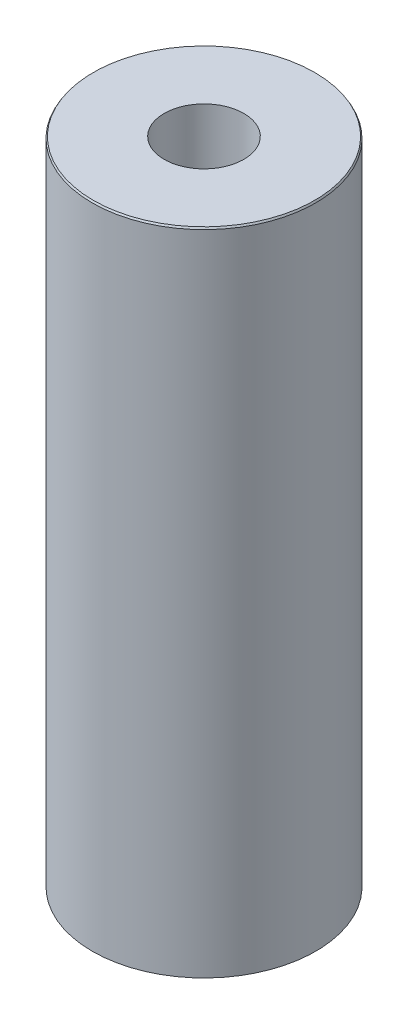
ISO-10303-21;
HEADER;
FILE_DESCRIPTION(('STEP AP214'),'2;1');
FILE_NAME('part.step','',(''),(''),'','','');
FILE_SCHEMA(('AUTOMOTIVE_DESIGN { 1 0 10303 214 1 1 1 1 }'));
ENDSEC;
DATA;
#1=APPLICATION_CONTEXT('core data for automotive mechanical design processes');
#2=APPLICATION_PROTOCOL_DEFINITION('international standard','automotive_design',2000,#1);
#3=PRODUCT_CONTEXT('',#1,'mechanical');
#4=PRODUCT('Part','Part','',(#3));
#5=PRODUCT_RELATED_PRODUCT_CATEGORY('part','',(#4));
#6=PRODUCT_DEFINITION_FORMATION('','',#4);
#7=PRODUCT_DEFINITION_CONTEXT('part definition',#1,'design');
#8=PRODUCT_DEFINITION('design','',#6,#7);
#9=PRODUCT_DEFINITION_SHAPE('','',#8);
#10=(LENGTH_UNIT() NAMED_UNIT(*) SI_UNIT(.MILLI.,.METRE.));
#11=(NAMED_UNIT(*) PLANE_ANGLE_UNIT() SI_UNIT($,.RADIAN.));
#12=(NAMED_UNIT(*) SI_UNIT($,.STERADIAN.) SOLID_ANGLE_UNIT());
#13=UNCERTAINTY_MEASURE_WITH_UNIT(LENGTH_MEASURE(1.E-05),#10,'distance_accuracy_value','');
#14=(GEOMETRIC_REPRESENTATION_CONTEXT(3) GLOBAL_UNCERTAINTY_ASSIGNED_CONTEXT((#13)) GLOBAL_UNIT_ASSIGNED_CONTEXT((#10,
#11,#12)) REPRESENTATION_CONTEXT('',''));
#15=CARTESIAN_POINT('',(0.,0.,0.));
#16=DIRECTION('',(0.,0.,1.));
#17=DIRECTION('',(1.,0.,0.));
#18=AXIS2_PLACEMENT_3D('',#15,#16,#17);
#19=CARTESIAN_POINT('',(0.,305.770544254768,0.));
#20=DIRECTION('',(0.,-1.,0.));
#21=DIRECTION('',(0.,0.,-1.));
#22=AXIS2_PLACEMENT_3D('',#19,#20,#21);
#23=CYLINDRICAL_SURFACE('',#22,52.5);
#24=CARTESIAN_POINT('',(0.,304.954214746591,0.));
#25=DIRECTION('',(0.,1.,0.));
#26=DIRECTION('',(0.,0.,1.));
#27=AXIS2_PLACEMENT_3D('',#24,#25,#26);
#28=CIRCLE('',#27,52.5);
#29=CARTESIAN_POINT('',(0.,304.954214746591,-52.5));
#30=VERTEX_POINT('',#29);
#31=EDGE_CURVE('E50',#30,#30,#28,.F.);
#32=CARTESIAN_POINT('',(0.,0.471308061293585,0.));
#33=DIRECTION('',(0.,1.,0.));
#34=DIRECTION('',(0.,0.,1.));
#35=AXIS2_PLACEMENT_3D('',#32,#33,#34);
#36=CIRCLE('',#35,52.5);
#37=CARTESIAN_POINT('',(0.,0.471308061293529,-52.5));
#38=VERTEX_POINT('',#37);
#39=EDGE_CURVE('E51',#38,#38,#36,.T.);
#40=CARTESIAN_POINT('',(0.,304.954214746591,-52.5));
#41=CARTESIAN_POINT('',(0.,301.782517801953,-52.5));
#42=CARTESIAN_POINT('',(0.,298.610820857314,-52.5));
#43=CARTESIAN_POINT('',(0.,292.267426968037,-52.5));
#44=CARTESIAN_POINT('',(0.,289.095730023399,-52.5));
#45=CARTESIAN_POINT('',(0.,282.752336134122,-52.5));
#46=CARTESIAN_POINT('',(0.,279.580639189483,-52.5));
#47=CARTESIAN_POINT('',(0.,273.237245300206,-52.5));
#48=CARTESIAN_POINT('',(0.,270.065548355568,-52.5));
#49=CARTESIAN_POINT('',(0.,263.722154466291,-52.5));
#50=CARTESIAN_POINT('',(0.,260.550457521652,-52.5));
#51=CARTESIAN_POINT('',(0.,254.207063632375,-52.5));
#52=CARTESIAN_POINT('',(0.,251.035366687737,-52.5));
#53=CARTESIAN_POINT('',(0.,244.691972798459,-52.5));
#54=CARTESIAN_POINT('',(0.,241.520275853821,-52.5));
#55=CARTESIAN_POINT('',(0.,235.176881964544,-52.5));
#56=CARTESIAN_POINT('',(0.,232.005185019905,-52.5));
#57=CARTESIAN_POINT('',(0.,225.661791130628,-52.5));
#58=CARTESIAN_POINT('',(0.,222.49009418599,-52.5));
#59=CARTESIAN_POINT('',(0.,216.146700296713,-52.5));
#60=CARTESIAN_POINT('',(0.,212.975003352074,-52.5));
#61=CARTESIAN_POINT('',(0.,206.631609462797,-52.5));
#62=CARTESIAN_POINT('',(0.,203.459912518159,-52.5));
#63=CARTESIAN_POINT('',(0.,197.116518628882,-52.5));
#64=CARTESIAN_POINT('',(0.,193.944821684243,-52.5));
#65=CARTESIAN_POINT('',(0.,187.601427794966,-52.5));
#66=CARTESIAN_POINT('',(0.,184.429730850328,-52.5));
#67=CARTESIAN_POINT('',(0.,178.086336961051,-52.5));
#68=CARTESIAN_POINT('',(0.,174.914640016412,-52.5));
#69=CARTESIAN_POINT('',(0.,168.571246127135,-52.5));
#70=CARTESIAN_POINT('',(0.,165.399549182496,-52.5));
#71=CARTESIAN_POINT('',(0.,159.056155293219,-52.5));
#72=CARTESIAN_POINT('',(0.,155.884458348581,-52.5));
#73=CARTESIAN_POINT('',(0.,149.541064459304,-52.5));
#74=CARTESIAN_POINT('',(0.,146.369367514665,-52.5));
#75=CARTESIAN_POINT('',(0.,140.025973625388,-52.5));
#76=CARTESIAN_POINT('',(0.,136.85427668075,-52.5));
#77=CARTESIAN_POINT('',(0.,130.510882791473,-52.5));
#78=CARTESIAN_POINT('',(0.,127.339185846834,-52.5));
#79=CARTESIAN_POINT('',(0.,120.995791957557,-52.5));
#80=CARTESIAN_POINT('',(0.,117.824095012919,-52.5));
#81=CARTESIAN_POINT('',(0.,111.480701123642,-52.5));
#82=CARTESIAN_POINT('',(0.,108.309004179003,-52.5));
#83=CARTESIAN_POINT('',(0.,101.965610289726,-52.5));
#84=CARTESIAN_POINT('',(0.,98.7939133450876,-52.5));
#85=CARTESIAN_POINT('',(0.,92.4505194558106,-52.5));
#86=CARTESIAN_POINT('',(0.,89.2788225111721,-52.5));
#87=CARTESIAN_POINT('',(0.,82.935428621895,-52.5));
#88=CARTESIAN_POINT('',(0.,79.7637316772565,-52.5));
#89=CARTESIAN_POINT('',(0.,73.4203377879795,-52.5));
#90=CARTESIAN_POINT('',(0.,70.2486408433409,-52.5));
#91=CARTESIAN_POINT('',(0.,63.9052469540639,-52.5));
#92=CARTESIAN_POINT('',(0.,60.7335500094254,-52.5));
#93=CARTESIAN_POINT('',(0.,54.3901561201483,-52.5));
#94=CARTESIAN_POINT('',(0.,51.2184591755098,-52.5));
#95=CARTESIAN_POINT('',(0.,44.8750652862328,-52.5));
#96=CARTESIAN_POINT('',(0.,41.7033683415942,-52.5));
#97=CARTESIAN_POINT('',(0.,35.3599744523172,-52.5));
#98=CARTESIAN_POINT('',(0.,32.1882775076787,-52.5));
#99=CARTESIAN_POINT('',(0.,25.8448836184017,-52.5));
#100=CARTESIAN_POINT('',(0.,22.6731866737632,-52.5));
#101=CARTESIAN_POINT('',(0.,16.3297927844861,-52.5));
#102=CARTESIAN_POINT('',(0.,13.1580958398476,-52.5));
#103=CARTESIAN_POINT('',(0.,6.81470195057056,-52.5));
#104=CARTESIAN_POINT('',(0.,3.64300500593204,-52.5));
#105=CARTESIAN_POINT('',(0.,0.471308061293529,-52.5));
#106=B_SPLINE_CURVE_WITH_KNOTS('',3,(#40,#41,#42,#43,#44,#45,#46,#47,#48,#49,#50,#51,#52,#53,
#54,#55,#56,#57,#58,#59,#60,#61,#62,#63,#64,#65,#66,#67,#68,#69,#70,#71,#72,#73,#74,#75,#76,#77,
#78,#79,#80,#81,#82,#83,#84,#85,#86,#87,#88,#89,#90,#91,#92,#93,#94,#95,#96,#97,#98,#99,#100,
#101,#102,#103,#104,#105),.UNSPECIFIED.,.F.,.F.,(4,2,2,2,2,2,2,2,2,2,2,2,2,2,2,2,2,2,2,2,2,2,2,
2,2,2,2,2,2,2,2,2,4),(0.,9.51509083391555,19.0301816678311,28.5452725017467,38.0603633356622,
47.5754541695778,57.0905450034933,66.6056358374089,76.1207266713244,85.63581750524,
95.1509083391555,104.665999173071,114.181090006987,123.696180840902,133.211271674818,
142.726362508733,152.241453342649,161.756544176564,171.27163501048,180.786725844396,
190.301816678311,199.816907512227,209.331998346142,218.847089180058,228.362180013973,
237.877270847889,247.392361681804,256.90745251572,266.422543349636,275.937634183551,
285.452725017467,294.967815851382,304.482906685298),.UNSPECIFIED.);
#107=EDGE_CURVE('BSEAM39',#30,#38,#106,.T.);
#108=ORIENTED_EDGE('',*,*,#31,.T.);
#109=ORIENTED_EDGE('',*,*,#39,.T.);
#110=ORIENTED_EDGE('',*,*,#107,.T.);
#111=ORIENTED_EDGE('',*,*,#107,.F.);
#112=EDGE_LOOP('',(#108,#110,#109,#111));
#113=FACE_BOUND('',#112,.T.);
#114=ADVANCED_FACE('F39',(#113),#23,.T.);
#115=CARTESIAN_POINT('',(0.,305.770544254768,0.));
#116=DIRECTION('',(0.,1.,0.));
#117=DIRECTION('',(0.,0.,1.));
#118=AXIS2_PLACEMENT_3D('',#115,#116,#117);
#119=PLANE('',#118);
#120=CARTESIAN_POINT('',(0.,305.770544254768,0.));
#121=DIRECTION('',(0.,1.,0.));
#122=DIRECTION('',(0.,0.,1.));
#123=AXIS2_PLACEMENT_3D('',#120,#121,#122);
#124=CIRCLE('',#123,52.0286919387067);
#125=CARTESIAN_POINT('',(0.,305.770544254768,-52.0286919387067));
#126=VERTEX_POINT('',#125);
#127=EDGE_CURVE('E54',#126,#126,#124,.T.);
#128=ORIENTED_EDGE('',*,*,#127,.T.);
#129=EDGE_LOOP('',(#128));
#130=FACE_BOUND('',#129,.T.);
#131=CARTESIAN_POINT('',(0.,305.770544254768,0.));
#132=DIRECTION('',(0.,1.,0.));
#133=DIRECTION('',(0.,0.,1.));
#134=AXIS2_PLACEMENT_3D('',#131,#132,#133);
#135=CIRCLE('',#134,18.7173574236483);
#136=CARTESIAN_POINT('',(0.,305.770544254768,-18.7173574236483));
#137=VERTEX_POINT('',#136);
#138=EDGE_CURVE('E58',#137,#137,#135,.T.);
#139=ORIENTED_EDGE('',*,*,#138,.F.);
#140=EDGE_LOOP('',(#139));
#141=FACE_BOUND('',#140,.T.);
#142=ADVANCED_FACE('F69',(#130,#141),#119,.T.);
#143=CARTESIAN_POINT('',(0.,0.,0.));
#144=DIRECTION('',(0.,1.,0.));
#145=DIRECTION('',(0.,0.,1.));
#146=AXIS2_PLACEMENT_3D('',#143,#144,#145);
#147=PLANE('',#146);
#148=CARTESIAN_POINT('',(0.,0.,0.));
#149=DIRECTION('',(0.,1.,0.));
#150=DIRECTION('',(0.,0.,1.));
#151=AXIS2_PLACEMENT_3D('',#148,#149,#150);
#152=CIRCLE('',#151,51.6836704918228);
#153=CARTESIAN_POINT('',(0.,0.,51.6836704918228));
#154=VERTEX_POINT('',#153);
#155=EDGE_CURVE('E10',#154,#154,#152,.F.);
#156=ORIENTED_EDGE('',*,*,#155,.T.);
#157=EDGE_LOOP('',(#156));
#158=FACE_BOUND('',#157,.T.);
#159=CARTESIAN_POINT('',(0.,0.,0.));
#160=DIRECTION('',(0.,1.,0.));
#161=DIRECTION('',(0.,0.,1.));
#162=AXIS2_PLACEMENT_3D('',#159,#160,#161);
#163=CIRCLE('',#162,18.7173574236483);
#164=CARTESIAN_POINT('',(0.,0.,-18.7173574236483));
#165=VERTEX_POINT('',#164);
#166=EDGE_CURVE('E63',#165,#165,#163,.T.);
#167=ORIENTED_EDGE('',*,*,#166,.T.);
#168=EDGE_LOOP('',(#167));
#169=FACE_BOUND('',#168,.T.);
#170=ADVANCED_FACE('F75',(#158,#169),#147,.F.);
#171=CARTESIAN_POINT('',(0.,305.770544254768,0.));
#172=DIRECTION('',(0.,-1.,0.));
#173=DIRECTION('',(0.,0.,-1.));
#174=AXIS2_PLACEMENT_3D('',#171,#172,#173);
#175=CYLINDRICAL_SURFACE('',#174,18.7173574236483);
#176=CARTESIAN_POINT('',(0.,305.770544254768,-18.7173574236483));
#177=CARTESIAN_POINT('',(0.,302.585434418781,-18.7173574236483));
#178=CARTESIAN_POINT('',(0.,299.400324582794,-18.7173574236483));
#179=CARTESIAN_POINT('',(0.,293.03010491082,-18.7173574236483));
#180=CARTESIAN_POINT('',(0.,289.844995074832,-18.7173574236483));
#181=CARTESIAN_POINT('',(0.,283.474775402858,-18.7173574236483));
#182=CARTESIAN_POINT('',(0.,280.289665566871,-18.7173574236483));
#183=CARTESIAN_POINT('',(0.,273.919445894897,-18.7173574236483));
#184=CARTESIAN_POINT('',(0.,270.734336058909,-18.7173574236483));
#185=CARTESIAN_POINT('',(0.,264.364116386935,-18.7173574236483));
#186=CARTESIAN_POINT('',(0.,261.179006550948,-18.7173574236483));
#187=CARTESIAN_POINT('',(0.,254.808786878973,-18.7173574236483));
#188=CARTESIAN_POINT('',(0.,251.623677042986,-18.7173574236483));
#189=CARTESIAN_POINT('',(0.,245.253457371012,-18.7173574236483));
#190=CARTESIAN_POINT('',(0.,242.068347535025,-18.7173574236483));
#191=CARTESIAN_POINT('',(0.,235.698127863051,-18.7173574236483));
#192=CARTESIAN_POINT('',(0.,232.513018027063,-18.7173574236483));
#193=CARTESIAN_POINT('',(0.,226.142798355089,-18.7173574236483));
#194=CARTESIAN_POINT('',(0.,222.957688519102,-18.7173574236483));
#195=CARTESIAN_POINT('',(0.,216.587468847127,-18.7173574236483));
#196=CARTESIAN_POINT('',(0.,213.40235901114,-18.7173574236483));
#197=CARTESIAN_POINT('',(0.,207.032139339166,-18.7173574236483));
#198=CARTESIAN_POINT('',(0.,203.847029503179,-18.7173574236483));
#199=CARTESIAN_POINT('',(0.,197.476809831204,-18.7173574236483));
#200=CARTESIAN_POINT('',(0.,194.291699995217,-18.7173574236483));
#201=CARTESIAN_POINT('',(0.,187.921480323243,-18.7173574236483));
#202=CARTESIAN_POINT('',(0.,184.736370487256,-18.7173574236483));
#203=CARTESIAN_POINT('',(0.,178.366150815281,-18.7173574236483));
#204=CARTESIAN_POINT('',(0.,175.181040979294,-18.7173574236483));
#205=CARTESIAN_POINT('',(0.,168.81082130732,-18.7173574236483));
#206=CARTESIAN_POINT('',(0.,165.625711471333,-18.7173574236483));
#207=CARTESIAN_POINT('',(0.,159.255491799358,-18.7173574236483));
#208=CARTESIAN_POINT('',(0.,156.070381963371,-18.7173574236483));
#209=CARTESIAN_POINT('',(0.,149.700162291397,-18.7173574236483));
#210=CARTESIAN_POINT('',(0.,146.51505245541,-18.7173574236483));
#211=CARTESIAN_POINT('',(0.,140.144832783435,-18.7173574236483));
#212=CARTESIAN_POINT('',(0.,136.959722947448,-18.7173574236483));
#213=CARTESIAN_POINT('',(0.,130.589503275474,-18.7173574236483));
#214=CARTESIAN_POINT('',(0.,127.404393439487,-18.7173574236483));
#215=CARTESIAN_POINT('',(0.,121.034173767512,-18.7173574236483));
#216=CARTESIAN_POINT('',(0.,117.849063931525,-18.7173574236483));
#217=CARTESIAN_POINT('',(0.,111.478844259551,-18.7173574236483));
#218=CARTESIAN_POINT('',(0.,108.293734423564,-18.7173574236483));
#219=CARTESIAN_POINT('',(0.,101.923514751589,-18.7173574236483));
#220=CARTESIAN_POINT('',(0.,98.7384049156022,-18.7173574236483));
#221=CARTESIAN_POINT('',(0.,92.3681852436279,-18.7173574236483));
#222=CARTESIAN_POINT('',(0.,89.1830754076407,-18.7173574236483));
#223=CARTESIAN_POINT('',(0.,82.8128557356664,-18.7173574236483));
#224=CARTESIAN_POINT('',(0.,79.6277458996792,-18.7173574236483));
#225=CARTESIAN_POINT('',(0.,73.2575262277048,-18.7173574236483));
#226=CARTESIAN_POINT('',(0.,70.0724163917177,-18.7173574236483));
#227=CARTESIAN_POINT('',(0.,63.7021967197433,-18.7173574236483));
#228=CARTESIAN_POINT('',(0.,60.5170868837562,-18.7173574236483));
#229=CARTESIAN_POINT('',(0.,54.1468672117818,-18.7173574236483));
#230=CARTESIAN_POINT('',(0.,50.9617573757946,-18.7173574236483));
#231=CARTESIAN_POINT('',(0.,44.5915377038203,-18.7173574236483));
#232=CARTESIAN_POINT('',(0.,41.4064278678331,-18.7173574236483));
#233=CARTESIAN_POINT('',(0.,35.0362081958588,-18.7173574236483));
#234=CARTESIAN_POINT('',(0.,31.8510983598716,-18.7173574236483));
#235=CARTESIAN_POINT('',(0.,25.4808786878973,-18.7173574236483));
#236=CARTESIAN_POINT('',(0.,22.2957688519101,-18.7173574236483));
#237=CARTESIAN_POINT('',(0.,15.9255491799358,-18.7173574236483));
#238=CARTESIAN_POINT('',(0.,12.7404393439486,-18.7173574236483));
#239=CARTESIAN_POINT('',(0.,6.37021967197428,-18.7173574236483));
#240=CARTESIAN_POINT('',(0.,3.18510983598712,-18.7173574236483));
#241=CARTESIAN_POINT('',(0.,0.,-18.7173574236483));
#242=B_SPLINE_CURVE_WITH_KNOTS('',3,(#176,#177,#178,#179,#180,#181,#182,#183,#184,#185,#186,
#187,#188,#189,#190,#191,#192,#193,#194,#195,#196,#197,#198,#199,#200,#201,#202,#203,#204,#205,
#206,#207,#208,#209,#210,#211,#212,#213,#214,#215,#216,#217,#218,#219,#220,#221,#222,#223,#224,
#225,#226,#227,#228,#229,#230,#231,#232,#233,#234,#235,#236,#237,#238,#239,#240,#241),
.UNSPECIFIED.,.F.,.F.,(4,2,2,2,2,2,2,2,2,2,2,2,2,2,2,2,2,2,2,2,2,2,2,2,2,2,2,2,2,2,2,2,4),(0.,
9.55532950796151,19.110659015923,28.6659885238845,38.221318031846,47.7766475398075,
57.331977047769,66.8873065557305,76.442636063692,85.9979655716535,95.553295079615,
105.108624587577,114.663954095538,124.2192836035,133.774613111461,143.329942619423,
152.885272127384,162.440601635346,171.995931143307,181.551260651269,191.10659015923,
200.661919667192,210.217249175153,219.772578683115,229.327908191076,238.883237699038,
248.438567206999,257.993896714961,267.549226222922,277.104555730884,286.659885238845,
296.215214746807,305.770544254768),.UNSPECIFIED.);
#243=EDGE_CURVE('BSEAM70',#137,#165,#242,.T.);
#244=ORIENTED_EDGE('',*,*,#138,.T.);
#245=ORIENTED_EDGE('',*,*,#166,.F.);
#246=ORIENTED_EDGE('',*,*,#243,.T.);
#247=ORIENTED_EDGE('',*,*,#243,.F.);
#248=EDGE_LOOP('',(#244,#246,#245,#247));
#249=FACE_BOUND('',#248,.T.);
#250=ADVANCED_FACE('F70',(#249),#175,.F.);
#251=CARTESIAN_POINT('',(0.,305.770544254768,0.));
#252=DIRECTION('',(0.,-1.,0.));
#253=DIRECTION('',(0.,0.,-1.));
#254=AXIS2_PLACEMENT_3D('',#251,#252,#253);
#255=CONICAL_SURFACE('',#254,52.0286919387067,0.523598775598259);
#256=CARTESIAN_POINT('',(0.,304.954214746591,-52.5));
#257=CARTESIAN_POINT('',(0.,304.962718178968,-52.4950905410282));
#258=CARTESIAN_POINT('',(0.,304.971221611345,-52.4901810820564));
#259=CARTESIAN_POINT('',(0.,304.988228476099,-52.4803621641128));
#260=CARTESIAN_POINT('',(0.,304.996731908476,-52.475452705141));
#261=CARTESIAN_POINT('',(0.,305.013738773229,-52.4656337871974));
#262=CARTESIAN_POINT('',(0.,305.022242205606,-52.4607243282256));
#263=CARTESIAN_POINT('',(0.,305.03924907036,-52.450905410282));
#264=CARTESIAN_POINT('',(0.,305.047752502737,-52.4459959513102));
#265=CARTESIAN_POINT('',(0.,305.06475936749,-52.4361770333665));
#266=CARTESIAN_POINT('',(0.,305.073262799867,-52.4312675743947));
#267=CARTESIAN_POINT('',(0.,305.090269664621,-52.4214486564511));
#268=CARTESIAN_POINT('',(0.,305.098773096998,-52.4165391974793));
#269=CARTESIAN_POINT('',(0.,305.115779961751,-52.4067202795357));
#270=CARTESIAN_POINT('',(0.,305.124283394128,-52.4018108205639));
#271=CARTESIAN_POINT('',(0.,305.141290258882,-52.3919919026203));
#272=CARTESIAN_POINT('',(0.,305.149793691259,-52.3870824436485));
#273=CARTESIAN_POINT('',(0.,305.166800556012,-52.3772635257049));
#274=CARTESIAN_POINT('',(0.,305.175303988389,-52.3723540667331));
#275=CARTESIAN_POINT('',(0.,305.192310853143,-52.3625351487895));
#276=CARTESIAN_POINT('',(0.,305.20081428552,-52.3576256898177));
#277=CARTESIAN_POINT('',(0.,305.217821150273,-52.347806771874));
#278=CARTESIAN_POINT('',(0.,305.22632458265,-52.3428973129022));
#279=CARTESIAN_POINT('',(0.,305.243331447404,-52.3330783949586));
#280=CARTESIAN_POINT('',(0.,305.251834879781,-52.3281689359868));
#281=CARTESIAN_POINT('',(0.,305.268841744534,-52.3183500180432));
#282=CARTESIAN_POINT('',(0.,305.277345176911,-52.3134405590714));
#283=CARTESIAN_POINT('',(0.,305.294352041665,-52.3036216411278));
#284=CARTESIAN_POINT('',(0.,305.302855474042,-52.298712182156));
#285=CARTESIAN_POINT('',(0.,305.319862338796,-52.2888932642124));
#286=CARTESIAN_POINT('',(0.,305.328365771172,-52.2839838052406));
#287=CARTESIAN_POINT('',(0.,305.345372635926,-52.274164887297));
#288=CARTESIAN_POINT('',(0.,305.353876068303,-52.2692554283252));
#289=CARTESIAN_POINT('',(0.,305.370882933057,-52.2594365103815));
#290=CARTESIAN_POINT('',(0.,305.379386365433,-52.2545270514097));
#291=CARTESIAN_POINT('',(0.,305.396393230187,-52.2447081334661));
#292=CARTESIAN_POINT('',(0.,305.404896662564,-52.2397986744943));
#293=CARTESIAN_POINT('',(0.,305.421903527318,-52.2299797565507));
#294=CARTESIAN_POINT('',(0.,305.430406959694,-52.2250702975789));
#295=CARTESIAN_POINT('',(0.,305.447413824448,-52.2152513796353));
#296=CARTESIAN_POINT('',(0.,305.455917256825,-52.2103419206635));
#297=CARTESIAN_POINT('',(0.,305.472924121579,-52.2005230027199));
#298=CARTESIAN_POINT('',(0.,305.481427553956,-52.1956135437481));
#299=CARTESIAN_POINT('',(0.,305.498434418709,-52.1857946258045));
#300=CARTESIAN_POINT('',(0.,305.506937851086,-52.1808851668327));
#301=CARTESIAN_POINT('',(0.,305.52394471584,-52.171066248889));
#302=CARTESIAN_POINT('',(0.,305.532448148217,-52.1661567899172));
#303=CARTESIAN_POINT('',(0.,305.54945501297,-52.1563378719736));
#304=CARTESIAN_POINT('',(0.,305.557958445347,-52.1514284130018));
#305=CARTESIAN_POINT('',(0.,305.574965310101,-52.1416094950582));
#306=CARTESIAN_POINT('',(0.,305.583468742478,-52.1367000360864));
#307=CARTESIAN_POINT('',(0.,305.600475607231,-52.1268811181428));
#308=CARTESIAN_POINT('',(0.,305.608979039608,-52.121971659171));
#309=CARTESIAN_POINT('',(0.,305.625985904362,-52.1121527412274));
#310=CARTESIAN_POINT('',(0.,305.634489336739,-52.1072432822556));
#311=CARTESIAN_POINT('',(0.,305.651496201492,-52.097424364312));
#312=CARTESIAN_POINT('',(0.,305.659999633869,-52.0925149053402));
#313=CARTESIAN_POINT('',(0.,305.677006498623,-52.0826959873966));
#314=CARTESIAN_POINT('',(0.,305.685509931,-52.0777865284248));
#315=CARTESIAN_POINT('',(0.,305.702516795754,-52.0679676104811));
#316=CARTESIAN_POINT('',(0.,305.71102022813,-52.0630581515093));
#317=CARTESIAN_POINT('',(0.,305.728027092884,-52.0532392335657));
#318=CARTESIAN_POINT('',(0.,305.736530525261,-52.0483297745939));
#319=CARTESIAN_POINT('',(0.,305.753537390015,-52.0385108566503));
#320=CARTESIAN_POINT('',(0.,305.762040822391,-52.0336013976785));
#321=CARTESIAN_POINT('',(0.,305.770544254768,-52.0286919387067));
#322=B_SPLINE_CURVE_WITH_KNOTS('',3,(#256,#257,#258,#259,#260,#261,#262,#263,#264,#265,#266,
#267,#268,#269,#270,#271,#272,#273,#274,#275,#276,#277,#278,#279,#280,#281,#282,#283,#284,#285,
#286,#287,#288,#289,#290,#291,#292,#293,#294,#295,#296,#297,#298,#299,#300,#301,#302,#303,#304,
#305,#306,#307,#308,#309,#310,#311,#312,#313,#314,#315,#316,#317,#318,#319,#320,#321),
.UNSPECIFIED.,.F.,.F.,(4,2,2,2,2,2,2,2,2,2,2,2,2,2,2,2,2,2,2,2,2,2,2,2,2,2,2,2,2,2,2,2,4),(0.,
0.0294567538308516,0.0589135076617031,0.0883702614925101,0.117827015323362,0.147283769154213,
0.17674052298502,0.206197276815872,0.235654030646675,0.265110784477527,0.294567538308382,
0.324024292139185,0.353481045970037,0.382937799800892,0.412394553631695,0.441851307462547,
0.471308061293354,0.500764815124205,0.530221568955057,0.559678322785864,0.589135076616715,
0.618591830447567,0.648048584278374,0.677505338109225,0.706962091940077,0.736418845770884,
0.765875599601735,0.795332353432539,0.824789107263391,0.854245861094246,0.883702614925049,
0.913159368755901,0.942616122586756),.UNSPECIFIED.);
#323=EDGE_CURVE('BSEAM81',#30,#126,#322,.T.);
#324=ORIENTED_EDGE('',*,*,#31,.F.);
#325=ORIENTED_EDGE('',*,*,#127,.F.);
#326=ORIENTED_EDGE('',*,*,#323,.T.);
#327=ORIENTED_EDGE('',*,*,#323,.F.);
#328=EDGE_LOOP('',(#324,#326,#325,#327));
#329=FACE_BOUND('',#328,.T.);
#330=ADVANCED_FACE('F81',(#329),#255,.T.);
#331=CARTESIAN_POINT('',(0.,0.471308061293529,0.));
#332=DIRECTION('',(0.,1.,0.));
#333=DIRECTION('',(0.,0.,1.));
#334=AXIS2_PLACEMENT_3D('',#331,#332,#333);
#335=CONICAL_SURFACE('',#334,52.5,1.04719755119662);
#336=ORIENTED_EDGE('',*,*,#155,.F.);
#337=EDGE_LOOP('',(#336));
#338=FACE_BOUND('',#337,.T.);
#339=ORIENTED_EDGE('',*,*,#39,.F.);
#340=EDGE_LOOP('',(#339));
#341=FACE_BOUND('',#340,.T.);
#342=ADVANCED_FACE('F45',(#338,#341),#335,.T.);
#343=CLOSED_SHELL('',(#114,#142,#170,#250,#330,#342));
#344=MANIFOLD_SOLID_BREP('B2',#343);
#345=ADVANCED_BREP_SHAPE_REPRESENTATION('',(#18,#344),#14);
#346=SHAPE_DEFINITION_REPRESENTATION(#9,#345);
ENDSEC;
END-ISO-10303-21;
